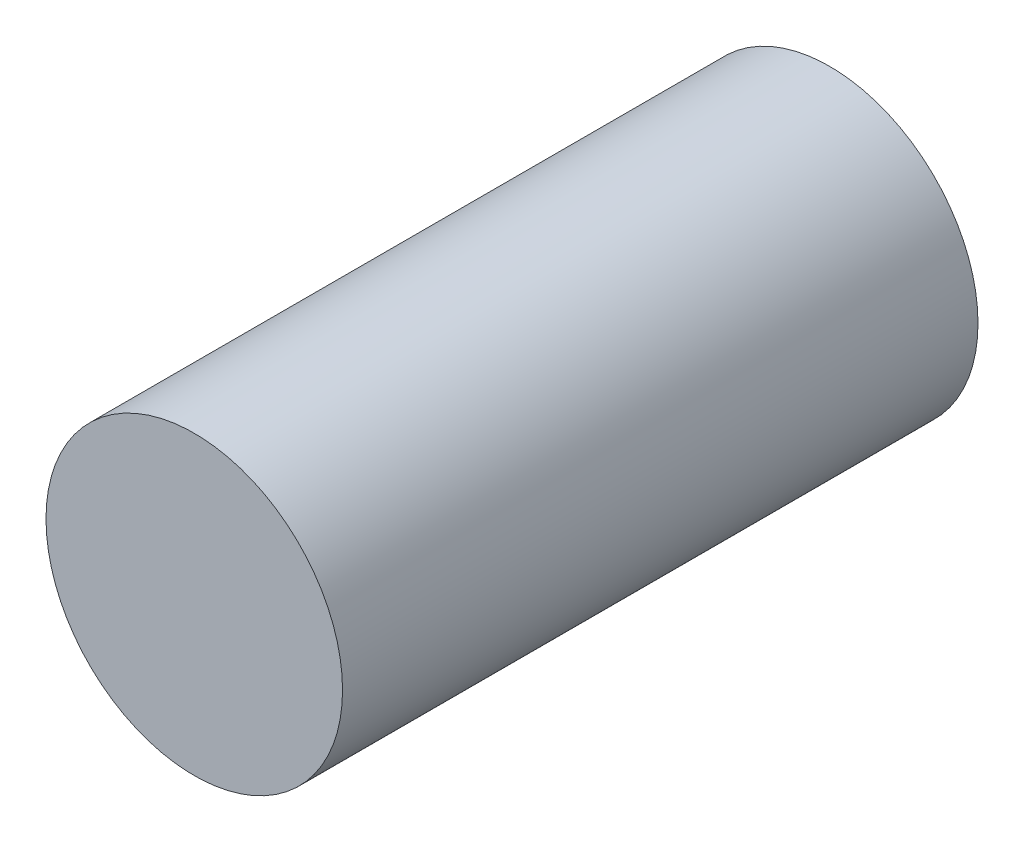
ISO-10303-21;
HEADER;
FILE_DESCRIPTION(('STEP AP214'),'2;1');
FILE_NAME('part.step','',(''),(''),'','','');
FILE_SCHEMA(('AUTOMOTIVE_DESIGN { 1 0 10303 214 1 1 1 1 }'));
ENDSEC;
DATA;
#1=APPLICATION_CONTEXT('core data for automotive mechanical design processes');
#2=APPLICATION_PROTOCOL_DEFINITION('international standard','automotive_design',2000,#1);
#3=PRODUCT_CONTEXT('',#1,'mechanical');
#4=PRODUCT('Part','Part','',(#3));
#5=PRODUCT_RELATED_PRODUCT_CATEGORY('part','',(#4));
#6=PRODUCT_DEFINITION_FORMATION('','',#4);
#7=PRODUCT_DEFINITION_CONTEXT('part definition',#1,'design');
#8=PRODUCT_DEFINITION('design','',#6,#7);
#9=PRODUCT_DEFINITION_SHAPE('','',#8);
#10=(LENGTH_UNIT() NAMED_UNIT(*) SI_UNIT(.MILLI.,.METRE.));
#11=(NAMED_UNIT(*) PLANE_ANGLE_UNIT() SI_UNIT($,.RADIAN.));
#12=(NAMED_UNIT(*) SI_UNIT($,.STERADIAN.) SOLID_ANGLE_UNIT());
#13=UNCERTAINTY_MEASURE_WITH_UNIT(LENGTH_MEASURE(1.E-05),#10,'distance_accuracy_value','');
#14=(GEOMETRIC_REPRESENTATION_CONTEXT(3) GLOBAL_UNCERTAINTY_ASSIGNED_CONTEXT((#13)) GLOBAL_UNIT_ASSIGNED_CONTEXT((#10,
#11,#12)) REPRESENTATION_CONTEXT('',''));
#15=CARTESIAN_POINT('',(0.,0.,0.));
#16=DIRECTION('',(0.,0.,1.));
#17=DIRECTION('',(1.,0.,0.));
#18=AXIS2_PLACEMENT_3D('',#15,#16,#17);
#19=CARTESIAN_POINT('',(0.,0.,15.24));
#20=DIRECTION('',(0.,0.,-1.));
#21=DIRECTION('',(-1.,0.,0.));
#22=AXIS2_PLACEMENT_3D('',#19,#20,#21);
#23=CYLINDRICAL_SURFACE('',#22,3.556);
#24=CARTESIAN_POINT('',(0.,0.,15.24));
#25=DIRECTION('',(0.,0.,1.));
#26=DIRECTION('',(1.,0.,0.));
#27=AXIS2_PLACEMENT_3D('',#24,#25,#26);
#28=CIRCLE('',#27,3.556);
#29=CARTESIAN_POINT('',(3.556,0.,15.24));
#30=VERTEX_POINT('',#29);
#31=EDGE_CURVE('E10',#30,#30,#28,.T.);
#32=ORIENTED_EDGE('',*,*,#31,.F.);
#33=EDGE_LOOP('',(#32));
#34=FACE_BOUND('',#33,.T.);
#35=CARTESIAN_POINT('',(0.,0.,0.));
#36=DIRECTION('',(0.,0.,1.));
#37=DIRECTION('',(1.,0.,0.));
#38=AXIS2_PLACEMENT_3D('',#35,#36,#37);
#39=CIRCLE('',#38,3.556);
#40=CARTESIAN_POINT('',(3.556,0.,0.));
#41=VERTEX_POINT('',#40);
#42=EDGE_CURVE('E34',#41,#41,#39,.T.);
#43=ORIENTED_EDGE('',*,*,#42,.T.);
#44=EDGE_LOOP('',(#43));
#45=FACE_BOUND('',#44,.T.);
#46=ADVANCED_FACE('F31',(#34,#45),#23,.T.);
#47=CARTESIAN_POINT('',(0.,0.,15.24));
#48=DIRECTION('',(0.,0.,1.));
#49=DIRECTION('',(1.,0.,0.));
#50=AXIS2_PLACEMENT_3D('',#47,#48,#49);
#51=PLANE('',#50);
#52=ORIENTED_EDGE('',*,*,#31,.T.);
#53=EDGE_LOOP('',(#52));
#54=FACE_BOUND('',#53,.T.);
#55=ADVANCED_FACE('F46',(#54),#51,.T.);
#56=CARTESIAN_POINT('',(0.,0.,0.));
#57=DIRECTION('',(0.,0.,1.));
#58=DIRECTION('',(1.,0.,0.));
#59=AXIS2_PLACEMENT_3D('',#56,#57,#58);
#60=PLANE('',#59);
#61=ORIENTED_EDGE('',*,*,#42,.F.);
#62=EDGE_LOOP('',(#61));
#63=FACE_BOUND('',#62,.T.);
#64=ADVANCED_FACE('F44',(#63),#60,.F.);
#65=CLOSED_SHELL('',(#46,#55,#64));
#66=MANIFOLD_SOLID_BREP('B2',#65);
#67=ADVANCED_BREP_SHAPE_REPRESENTATION('',(#18,#66),#14);
#68=SHAPE_DEFINITION_REPRESENTATION(#9,#67);
ENDSEC;
END-ISO-10303-21;
